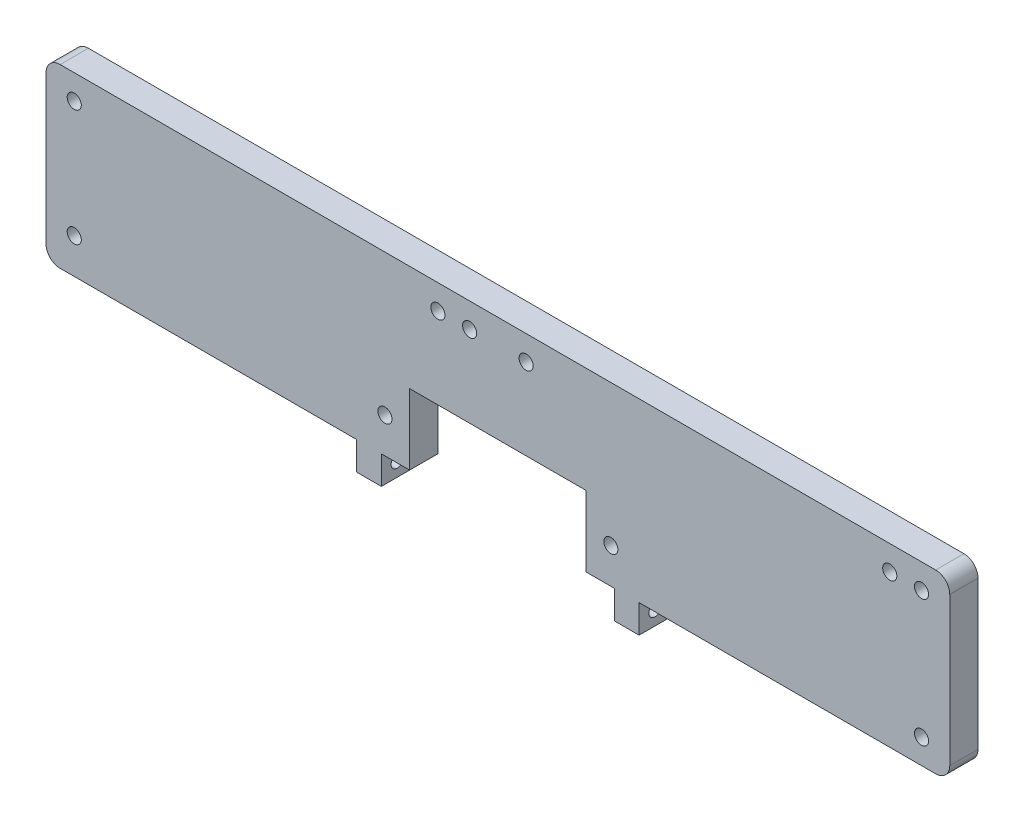
ISO-10303-21;
HEADER;
FILE_DESCRIPTION(('STEP AP214'),'2;1');
FILE_NAME('part.step','',(''),(''),'','','');
FILE_SCHEMA(('AUTOMOTIVE_DESIGN { 1 0 10303 214 1 1 1 1 }'));
ENDSEC;
DATA;
#1=APPLICATION_CONTEXT('core data for automotive mechanical design processes');
#2=APPLICATION_PROTOCOL_DEFINITION('international standard','automotive_design',2000,#1);
#3=PRODUCT_CONTEXT('',#1,'mechanical');
#4=PRODUCT('Part','Part','',(#3));
#5=PRODUCT_RELATED_PRODUCT_CATEGORY('part','',(#4));
#6=PRODUCT_DEFINITION_FORMATION('','',#4);
#7=PRODUCT_DEFINITION_CONTEXT('part definition',#1,'design');
#8=PRODUCT_DEFINITION('design','',#6,#7);
#9=PRODUCT_DEFINITION_SHAPE('','',#8);
#10=(LENGTH_UNIT() NAMED_UNIT(*) SI_UNIT(.MILLI.,.METRE.));
#11=(NAMED_UNIT(*) PLANE_ANGLE_UNIT() SI_UNIT($,.RADIAN.));
#12=(NAMED_UNIT(*) SI_UNIT($,.STERADIAN.) SOLID_ANGLE_UNIT());
#13=UNCERTAINTY_MEASURE_WITH_UNIT(LENGTH_MEASURE(1.E-05),#10,'distance_accuracy_value','');
#14=(GEOMETRIC_REPRESENTATION_CONTEXT(3) GLOBAL_UNCERTAINTY_ASSIGNED_CONTEXT((#13)) GLOBAL_UNIT_ASSIGNED_CONTEXT((#10,
#11,#12)) REPRESENTATION_CONTEXT('',''));
#15=CARTESIAN_POINT('',(0.,0.,0.));
#16=DIRECTION('',(0.,0.,1.));
#17=DIRECTION('',(1.,0.,0.));
#18=AXIS2_PLACEMENT_3D('',#15,#16,#17);
#19=CARTESIAN_POINT('',(-127.716190957769,22.106089776624,8.));
#20=DIRECTION('',(0.,1.,0.));
#21=DIRECTION('',(0.,0.,1.));
#22=AXIS2_PLACEMENT_3D('',#19,#20,#21);
#23=PLANE('',#22);
#24=DIRECTION('',(1.,0.,0.));
#25=VECTOR('',#24,1.);
#26=CARTESIAN_POINT('',(-127.716190957769,22.106089776624,0.));
#27=LINE('',#26,#25);
#28=CARTESIAN_POINT('',(-32.716190957769,22.106089776624,0.));
#29=VERTEX_POINT('',#28);
#30=CARTESIAN_POINT('',(-24.716190957769,22.106089776624,0.));
#31=VERTEX_POINT('',#30);
#32=EDGE_CURVE('E197',#29,#31,#27,.T.);
#33=ORIENTED_EDGE('',*,*,#32,.T.);
#34=DIRECTION('',(0.,0.,1.));
#35=VECTOR('',#34,1.);
#36=CARTESIAN_POINT('',(-24.716190957769,22.106089776624,0.));
#37=LINE('',#36,#35);
#38=CARTESIAN_POINT('',(-24.716190957769,22.106089776624,8.));
#39=VERTEX_POINT('',#38);
#40=EDGE_CURVE('E181',#31,#39,#37,.T.);
#41=ORIENTED_EDGE('',*,*,#40,.T.);
#42=DIRECTION('',(1.,0.,0.));
#43=VECTOR('',#42,1.);
#44=CARTESIAN_POINT('',(-127.716190957769,22.106089776624,8.));
#45=LINE('',#44,#43);
#46=CARTESIAN_POINT('',(-32.716190957769,22.106089776624,8.));
#47=VERTEX_POINT('',#46);
#48=EDGE_CURVE('E248',#47,#39,#45,.T.);
#49=ORIENTED_EDGE('',*,*,#48,.F.);
#50=DIRECTION('',(0.,0.,1.));
#51=VECTOR('',#50,1.);
#52=CARTESIAN_POINT('',(-32.716190957769,22.106089776624,0.));
#53=LINE('',#52,#51);
#54=EDGE_CURVE('E204',#29,#47,#53,.T.);
#55=ORIENTED_EDGE('',*,*,#54,.F.);
#56=EDGE_LOOP('',(#33,#41,#49,#55));
#57=FACE_BOUND('',#56,.T.);
#58=ADVANCED_FACE('F41',(#57),#23,.F.);
#59=CARTESIAN_POINT('',(25.283809042231,22.106089776624,8.));
#60=VERTEX_POINT('',#59);
#61=CARTESIAN_POINT('',(33.283809042231,22.106089776624,8.));
#62=VERTEX_POINT('',#61);
#63=EDGE_CURVE('E249',#60,#62,#45,.T.);
#64=ORIENTED_EDGE('',*,*,#63,.F.);
#65=DIRECTION('',(0.,0.,1.));
#66=VECTOR('',#65,1.);
#67=CARTESIAN_POINT('',(25.283809042231,22.106089776624,0.));
#68=LINE('',#67,#66);
#69=CARTESIAN_POINT('',(25.283809042231,22.106089776624,0.));
#70=VERTEX_POINT('',#69);
#71=EDGE_CURVE('E191',#70,#60,#68,.T.);
#72=ORIENTED_EDGE('',*,*,#71,.F.);
#73=CARTESIAN_POINT('',(33.283809042231,22.106089776624,0.));
#74=VERTEX_POINT('',#73);
#75=EDGE_CURVE('E207',#70,#74,#27,.T.);
#76=ORIENTED_EDGE('',*,*,#75,.T.);
#77=DIRECTION('',(0.,0.,1.));
#78=VECTOR('',#77,1.);
#79=CARTESIAN_POINT('',(33.283809042231,22.106089776624,0.));
#80=LINE('',#79,#78);
#81=EDGE_CURVE('E304',#74,#62,#80,.T.);
#82=ORIENTED_EDGE('',*,*,#81,.T.);
#83=EDGE_LOOP('',(#64,#72,#76,#82));
#84=FACE_BOUND('',#83,.T.);
#85=ADVANCED_FACE('F457',(#84),#23,.F.);
#86=DIRECTION('',(0.,0.,1.));
#87=VECTOR('',#86,1.);
#88=CARTESIAN_POINT('',(40.283809042231,22.106089776624,0.));
#89=LINE('',#88,#87);
#90=CARTESIAN_POINT('',(40.283809042231,22.106089776624,0.));
#91=VERTEX_POINT('',#90);
#92=CARTESIAN_POINT('',(40.283809042231,22.106089776624,8.));
#93=VERTEX_POINT('',#92);
#94=EDGE_CURVE('E300',#91,#93,#89,.T.);
#95=ORIENTED_EDGE('',*,*,#94,.F.);
#96=CARTESIAN_POINT('',(124.283809042231,22.106089776624,0.));
#97=VERTEX_POINT('',#96);
#98=EDGE_CURVE('E209',#91,#97,#27,.T.);
#99=ORIENTED_EDGE('',*,*,#98,.T.);
#100=DIRECTION('',(0.,0.,-1.));
#101=VECTOR('',#100,1.);
#102=CARTESIAN_POINT('',(124.283809042231,22.106089776624,8.));
#103=LINE('',#102,#101);
#104=CARTESIAN_POINT('',(124.283809042231,22.106089776624,8.));
#105=VERTEX_POINT('',#104);
#106=EDGE_CURVE('E239',#97,#105,#103,.F.);
#107=ORIENTED_EDGE('',*,*,#106,.T.);
#108=EDGE_CURVE('E250',#93,#105,#45,.T.);
#109=ORIENTED_EDGE('',*,*,#108,.F.);
#110=EDGE_LOOP('',(#95,#99,#107,#109));
#111=FACE_BOUND('',#110,.T.);
#112=ADVANCED_FACE('F463',(#111),#23,.F.);
#113=CARTESIAN_POINT('',(0.,0.,8.));
#114=DIRECTION('',(0.,0.,1.));
#115=DIRECTION('',(1.,0.,0.));
#116=AXIS2_PLACEMENT_3D('',#113,#114,#115);
#117=PLANE('',#116);
#118=CARTESIAN_POINT('',(120.283809042231,29.106089776624,8.));
#119=DIRECTION('',(0.,0.,1.));
#120=DIRECTION('',(1.,0.,0.));
#121=AXIS2_PLACEMENT_3D('',#118,#119,#120);
#122=CIRCLE('',#121,2.);
#123=CARTESIAN_POINT('',(122.283809042231,29.106089776624,8.));
#124=VERTEX_POINT('',#123);
#125=EDGE_CURVE('E399',#124,#124,#122,.T.);
#126=ORIENTED_EDGE('',*,*,#125,.F.);
#127=EDGE_LOOP('',(#126));
#128=FACE_BOUND('',#127,.T.);
#129=CARTESIAN_POINT('',(-119.716190957769,32.106089776624,8.));
#130=DIRECTION('',(0.,0.,1.));
#131=DIRECTION('',(1.,0.,0.));
#132=AXIS2_PLACEMENT_3D('',#129,#130,#131);
#133=CIRCLE('',#132,2.);
#134=CARTESIAN_POINT('',(-117.716190957769,32.106089776624,8.));
#135=VERTEX_POINT('',#134);
#136=EDGE_CURVE('E408',#135,#135,#133,.T.);
#137=ORIENTED_EDGE('',*,*,#136,.F.);
#138=EDGE_LOOP('',(#137));
#139=FACE_BOUND('',#138,.T.);
#140=CARTESIAN_POINT('',(32.283809042231,32.106089776624,8.));
#141=DIRECTION('',(0.,0.,1.));
#142=DIRECTION('',(1.,0.,0.));
#143=AXIS2_PLACEMENT_3D('',#140,#141,#142);
#144=CIRCLE('',#143,2.);
#145=CARTESIAN_POINT('',(34.283809042231,32.106089776624,8.));
#146=VERTEX_POINT('',#145);
#147=EDGE_CURVE('E416',#146,#146,#144,.T.);
#148=ORIENTED_EDGE('',*,*,#147,.F.);
#149=EDGE_LOOP('',(#148));
#150=FACE_BOUND('',#149,.T.);
#151=CARTESIAN_POINT('',(-31.716190957769,32.106089776624,8.));
#152=DIRECTION('',(0.,0.,1.));
#153=DIRECTION('',(1.,0.,0.));
#154=AXIS2_PLACEMENT_3D('',#151,#152,#153);
#155=CIRCLE('',#154,2.);
#156=CARTESIAN_POINT('',(-29.716190957769,32.106089776624,8.));
#157=VERTEX_POINT('',#156);
#158=EDGE_CURVE('E391',#157,#157,#155,.T.);
#159=ORIENTED_EDGE('',*,*,#158,.F.);
#160=EDGE_LOOP('',(#159));
#161=FACE_BOUND('',#160,.T.);
#162=DIRECTION('',(0.,-1.,0.));
#163=VECTOR('',#162,1.);
#164=CARTESIAN_POINT('',(-24.716190957769,42.106089776624,8.));
#165=LINE('',#164,#163);
#166=CARTESIAN_POINT('',(-24.716190957769,42.106089776624,8.));
#167=VERTEX_POINT('',#166);
#168=EDGE_CURVE('E186',#167,#39,#165,.T.);
#169=ORIENTED_EDGE('',*,*,#168,.F.);
#170=DIRECTION('',(-1.,0.,0.));
#171=VECTOR('',#170,1.);
#172=CARTESIAN_POINT('',(-24.716190957769,42.106089776624,8.));
#173=LINE('',#172,#171);
#174=CARTESIAN_POINT('',(25.283809042231,42.106089776624,8.));
#175=VERTEX_POINT('',#174);
#176=EDGE_CURVE('E201',#175,#167,#173,.T.);
#177=ORIENTED_EDGE('',*,*,#176,.F.);
#178=DIRECTION('',(0.,1.,0.));
#179=VECTOR('',#178,1.);
#180=CARTESIAN_POINT('',(25.283809042231,42.106089776624,8.));
#181=LINE('',#180,#179);
#182=EDGE_CURVE('E380',#60,#175,#181,.T.);
#183=ORIENTED_EDGE('',*,*,#182,.F.);
#184=ORIENTED_EDGE('',*,*,#63,.T.);
#185=DIRECTION('',(0.,-1.,0.));
#186=VECTOR('',#185,1.);
#187=CARTESIAN_POINT('',(33.283809042231,0.,8.));
#188=LINE('',#187,#186);
#189=CARTESIAN_POINT('',(33.283809042231,14.106089776624,8.));
#190=VERTEX_POINT('',#189);
#191=EDGE_CURVE('E319',#62,#190,#188,.T.);
#192=ORIENTED_EDGE('',*,*,#191,.T.);
#193=DIRECTION('',(1.,0.,0.));
#194=VECTOR('',#193,1.);
#195=CARTESIAN_POINT('',(0.,14.106089776624,8.));
#196=LINE('',#195,#194);
#197=CARTESIAN_POINT('',(40.283809042231,14.106089776624,8.));
#198=VERTEX_POINT('',#197);
#199=EDGE_CURVE('E314',#190,#198,#196,.T.);
#200=ORIENTED_EDGE('',*,*,#199,.T.);
#201=DIRECTION('',(0.,-1.,0.));
#202=VECTOR('',#201,1.);
#203=CARTESIAN_POINT('',(40.283809042231,0.,8.));
#204=LINE('',#203,#202);
#205=EDGE_CURVE('E323',#93,#198,#204,.T.);
#206=ORIENTED_EDGE('',*,*,#205,.F.);
#207=ORIENTED_EDGE('',*,*,#108,.T.);
#208=CARTESIAN_POINT('',(124.283809042231,26.106089776624,8.));
#209=DIRECTION('',(0.,0.,1.));
#210=DIRECTION('',(1.,0.,0.));
#211=AXIS2_PLACEMENT_3D('',#208,#209,#210);
#212=CIRCLE('',#211,4.);
#213=CARTESIAN_POINT('',(128.283809042231,26.106089776624,8.));
#214=VERTEX_POINT('',#213);
#215=EDGE_CURVE('E501',#105,#214,#212,.T.);
#216=ORIENTED_EDGE('',*,*,#215,.T.);
#217=DIRECTION('',(0.,1.,0.));
#218=VECTOR('',#217,1.);
#219=CARTESIAN_POINT('',(128.283809042231,72.106089776624,8.));
#220=LINE('',#219,#218);
#221=CARTESIAN_POINT('',(128.283809042231,68.106089776624,8.));
#222=VERTEX_POINT('',#221);
#223=EDGE_CURVE('E240',#214,#222,#220,.T.);
#224=ORIENTED_EDGE('',*,*,#223,.T.);
#225=CARTESIAN_POINT('',(124.283809042231,68.106089776624,8.));
#226=DIRECTION('',(0.,0.,1.));
#227=DIRECTION('',(1.,0.,0.));
#228=AXIS2_PLACEMENT_3D('',#225,#226,#227);
#229=CIRCLE('',#228,4.);
#230=CARTESIAN_POINT('',(124.283809042231,72.106089776624,8.));
#231=VERTEX_POINT('',#230);
#232=EDGE_CURVE('E526',#222,#231,#229,.T.);
#233=ORIENTED_EDGE('',*,*,#232,.T.);
#234=DIRECTION('',(-1.,0.,0.));
#235=VECTOR('',#234,1.);
#236=CARTESIAN_POINT('',(-127.716190957769,72.106089776624,8.));
#237=LINE('',#236,#235);
#238=CARTESIAN_POINT('',(-123.716190957769,72.106089776624,8.));
#239=VERTEX_POINT('',#238);
#240=EDGE_CURVE('E235',#231,#239,#237,.T.);
#241=ORIENTED_EDGE('',*,*,#240,.T.);
#242=CARTESIAN_POINT('',(-123.716190957769,68.106089776624,8.));
#243=DIRECTION('',(0.,0.,1.));
#244=DIRECTION('',(1.,0.,0.));
#245=AXIS2_PLACEMENT_3D('',#242,#243,#244);
#246=CIRCLE('',#245,4.);
#247=CARTESIAN_POINT('',(-127.716190957769,68.106089776624,8.));
#248=VERTEX_POINT('',#247);
#249=EDGE_CURVE('E523',#239,#248,#246,.T.);
#250=ORIENTED_EDGE('',*,*,#249,.T.);
#251=DIRECTION('',(0.,-1.,0.));
#252=VECTOR('',#251,1.);
#253=CARTESIAN_POINT('',(-127.716190957769,72.106089776624,8.));
#254=LINE('',#253,#252);
#255=CARTESIAN_POINT('',(-127.716190957769,26.106089776624,8.));
#256=VERTEX_POINT('',#255);
#257=EDGE_CURVE('E251',#248,#256,#254,.T.);
#258=ORIENTED_EDGE('',*,*,#257,.T.);
#259=CARTESIAN_POINT('',(-123.716190957769,26.106089776624,8.));
#260=DIRECTION('',(0.,0.,1.));
#261=DIRECTION('',(1.,0.,0.));
#262=AXIS2_PLACEMENT_3D('',#259,#260,#261);
#263=CIRCLE('',#262,4.);
#264=CARTESIAN_POINT('',(-123.716190957769,22.106089776624,8.));
#265=VERTEX_POINT('',#264);
#266=EDGE_CURVE('E531',#256,#265,#263,.T.);
#267=ORIENTED_EDGE('',*,*,#266,.T.);
#268=CARTESIAN_POINT('',(-39.7161909577704,22.106089776624,8.));
#269=VERTEX_POINT('',#268);
#270=EDGE_CURVE('E244',#265,#269,#45,.T.);
#271=ORIENTED_EDGE('',*,*,#270,.T.);
#272=DIRECTION('',(1.76074432811646E-13,-1.,0.));
#273=VECTOR('',#272,1.);
#274=CARTESIAN_POINT('',(-39.7161909577704,22.106089776624,8.));
#275=LINE('',#274,#273);
#276=CARTESIAN_POINT('',(-39.716190957769,14.106089776624,8.));
#277=VERTEX_POINT('',#276);
#278=EDGE_CURVE('E351',#269,#277,#275,.T.);
#279=ORIENTED_EDGE('',*,*,#278,.T.);
#280=DIRECTION('',(-1.,0.,0.));
#281=VECTOR('',#280,1.);
#282=CARTESIAN_POINT('',(-32.716190957769,14.106089776624,8.));
#283=LINE('',#282,#281);
#284=CARTESIAN_POINT('',(-32.716190957769,14.106089776624,8.));
#285=VERTEX_POINT('',#284);
#286=EDGE_CURVE('E327',#285,#277,#283,.T.);
#287=ORIENTED_EDGE('',*,*,#286,.F.);
#288=DIRECTION('',(0.,-1.,0.));
#289=VECTOR('',#288,1.);
#290=CARTESIAN_POINT('',(-32.716190957769,22.106089776624,8.));
#291=LINE('',#290,#289);
#292=EDGE_CURVE('E66',#47,#285,#291,.T.);
#293=ORIENTED_EDGE('',*,*,#292,.F.);
#294=ORIENTED_EDGE('',*,*,#48,.T.);
#295=EDGE_LOOP('',(#169,#177,#183,#184,#192,#200,#206,#207,#216,#224,#233,#241,#250,#258,#267,
#271,#279,#287,#293,#294));
#296=FACE_BOUND('',#295,.T.);
#297=CARTESIAN_POINT('',(-16.716190957769,65.106089776624,8.));
#298=DIRECTION('',(0.,0.,1.));
#299=DIRECTION('',(1.,0.,0.));
#300=AXIS2_PLACEMENT_3D('',#297,#298,#299);
#301=CIRCLE('',#300,2.);
#302=CARTESIAN_POINT('',(-14.716190957769,65.106089776624,8.));
#303=VERTEX_POINT('',#302);
#304=EDGE_CURVE('E280',#303,#303,#301,.T.);
#305=ORIENTED_EDGE('',*,*,#304,.F.);
#306=EDGE_LOOP('',(#305));
#307=FACE_BOUND('',#306,.T.);
#308=CARTESIAN_POINT('',(8.28380904223103,65.106089776624,8.));
#309=DIRECTION('',(0.,0.,1.));
#310=DIRECTION('',(1.,0.,0.));
#311=AXIS2_PLACEMENT_3D('',#308,#309,#310);
#312=CIRCLE('',#311,2.);
#313=CARTESIAN_POINT('',(10.283809042231,65.106089776624,8.));
#314=VERTEX_POINT('',#313);
#315=EDGE_CURVE('E264',#314,#314,#312,.T.);
#316=ORIENTED_EDGE('',*,*,#315,.F.);
#317=EDGE_LOOP('',(#316));
#318=FACE_BOUND('',#317,.T.);
#319=CARTESIAN_POINT('',(120.283809042231,65.106089776624,8.));
#320=DIRECTION('',(0.,0.,1.));
#321=DIRECTION('',(1.,0.,0.));
#322=AXIS2_PLACEMENT_3D('',#319,#320,#321);
#323=CIRCLE('',#322,2.);
#324=CARTESIAN_POINT('',(122.283809042231,65.106089776624,8.));
#325=VERTEX_POINT('',#324);
#326=EDGE_CURVE('E225',#325,#325,#323,.T.);
#327=ORIENTED_EDGE('',*,*,#326,.F.);
#328=EDGE_LOOP('',(#327));
#329=FACE_BOUND('',#328,.T.);
#330=CARTESIAN_POINT('',(111.283809042231,65.106089776624,8.));
#331=DIRECTION('',(0.,0.,1.));
#332=DIRECTION('',(1.,0.,0.));
#333=AXIS2_PLACEMENT_3D('',#330,#331,#332);
#334=CIRCLE('',#333,2.);
#335=CARTESIAN_POINT('',(113.283809042231,65.106089776624,8.));
#336=VERTEX_POINT('',#335);
#337=EDGE_CURVE('E258',#336,#336,#334,.T.);
#338=ORIENTED_EDGE('',*,*,#337,.F.);
#339=EDGE_LOOP('',(#338));
#340=FACE_BOUND('',#339,.T.);
#341=CARTESIAN_POINT('',(-7.71619095776897,65.106089776624,8.));
#342=DIRECTION('',(0.,0.,1.));
#343=DIRECTION('',(1.,0.,0.));
#344=AXIS2_PLACEMENT_3D('',#341,#342,#343);
#345=CIRCLE('',#344,2.);
#346=CARTESIAN_POINT('',(-5.71619095776897,65.106089776624,8.));
#347=VERTEX_POINT('',#346);
#348=EDGE_CURVE('E272',#347,#347,#345,.T.);
#349=ORIENTED_EDGE('',*,*,#348,.F.);
#350=EDGE_LOOP('',(#349));
#351=FACE_BOUND('',#350,.T.);
#352=CARTESIAN_POINT('',(-119.716190957769,65.106089776624,8.));
#353=DIRECTION('',(0.,0.,1.));
#354=DIRECTION('',(1.,0.,0.));
#355=AXIS2_PLACEMENT_3D('',#352,#353,#354);
#356=CIRCLE('',#355,2.);
#357=CARTESIAN_POINT('',(-117.716190957769,65.106089776624,8.));
#358=VERTEX_POINT('',#357);
#359=EDGE_CURVE('E288',#358,#358,#356,.T.);
#360=ORIENTED_EDGE('',*,*,#359,.F.);
#361=EDGE_LOOP('',(#360));
#362=FACE_BOUND('',#361,.T.);
#363=ADVANCED_FACE('F478',(#128,#139,#150,#161,#296,#307,#318,#329,#340,#351,#362),#117,.T.);
#364=CARTESIAN_POINT('',(0.,0.,0.));
#365=DIRECTION('',(0.,0.,1.));
#366=DIRECTION('',(1.,0.,0.));
#367=AXIS2_PLACEMENT_3D('',#364,#365,#366);
#368=PLANE('',#367);
#369=CARTESIAN_POINT('',(120.283809042231,29.106089776624,0.));
#370=DIRECTION('',(0.,0.,1.));
#371=DIRECTION('',(1.,0.,0.));
#372=AXIS2_PLACEMENT_3D('',#369,#370,#371);
#373=CIRCLE('',#372,2.);
#374=CARTESIAN_POINT('',(122.283809042231,29.106089776624,0.));
#375=VERTEX_POINT('',#374);
#376=EDGE_CURVE('E403',#375,#375,#373,.T.);
#377=ORIENTED_EDGE('',*,*,#376,.T.);
#378=EDGE_LOOP('',(#377));
#379=FACE_BOUND('',#378,.T.);
#380=CARTESIAN_POINT('',(-119.716190957769,32.106089776624,0.));
#381=DIRECTION('',(0.,0.,1.));
#382=DIRECTION('',(1.,0.,0.));
#383=AXIS2_PLACEMENT_3D('',#380,#381,#382);
#384=CIRCLE('',#383,2.);
#385=CARTESIAN_POINT('',(-117.716190957769,32.106089776624,0.));
#386=VERTEX_POINT('',#385);
#387=EDGE_CURVE('E412',#386,#386,#384,.T.);
#388=ORIENTED_EDGE('',*,*,#387,.T.);
#389=EDGE_LOOP('',(#388));
#390=FACE_BOUND('',#389,.T.);
#391=CARTESIAN_POINT('',(32.283809042231,32.106089776624,0.));
#392=DIRECTION('',(0.,0.,1.));
#393=DIRECTION('',(1.,0.,0.));
#394=AXIS2_PLACEMENT_3D('',#391,#392,#393);
#395=CIRCLE('',#394,2.);
#396=CARTESIAN_POINT('',(34.283809042231,32.106089776624,0.));
#397=VERTEX_POINT('',#396);
#398=EDGE_CURVE('E395',#397,#397,#395,.T.);
#399=ORIENTED_EDGE('',*,*,#398,.T.);
#400=EDGE_LOOP('',(#399));
#401=FACE_BOUND('',#400,.T.);
#402=CARTESIAN_POINT('',(-31.716190957769,32.106089776624,0.));
#403=DIRECTION('',(0.,0.,1.));
#404=DIRECTION('',(1.,0.,0.));
#405=AXIS2_PLACEMENT_3D('',#402,#403,#404);
#406=CIRCLE('',#405,2.);
#407=CARTESIAN_POINT('',(-29.716190957769,32.106089776624,0.));
#408=VERTEX_POINT('',#407);
#409=EDGE_CURVE('E386',#408,#408,#406,.T.);
#410=ORIENTED_EDGE('',*,*,#409,.T.);
#411=EDGE_LOOP('',(#410));
#412=FACE_BOUND('',#411,.T.);
#413=DIRECTION('',(-1.,0.,0.));
#414=VECTOR('',#413,1.);
#415=CARTESIAN_POINT('',(-24.716190957769,42.106089776624,0.));
#416=LINE('',#415,#414);
#417=CARTESIAN_POINT('',(25.283809042231,42.106089776624,0.));
#418=VERTEX_POINT('',#417);
#419=CARTESIAN_POINT('',(-24.716190957769,42.106089776624,0.));
#420=VERTEX_POINT('',#419);
#421=EDGE_CURVE('E58',#418,#420,#416,.T.);
#422=ORIENTED_EDGE('',*,*,#421,.T.);
#423=DIRECTION('',(0.,-1.,0.));
#424=VECTOR('',#423,1.);
#425=CARTESIAN_POINT('',(-24.716190957769,42.106089776624,0.));
#426=LINE('',#425,#424);
#427=EDGE_CURVE('E184',#420,#31,#426,.T.);
#428=ORIENTED_EDGE('',*,*,#427,.T.);
#429=ORIENTED_EDGE('',*,*,#32,.F.);
#430=DIRECTION('',(0.,-1.,0.));
#431=VECTOR('',#430,1.);
#432=CARTESIAN_POINT('',(-32.716190957769,22.106089776624,0.));
#433=LINE('',#432,#431);
#434=CARTESIAN_POINT('',(-32.716190957769,14.106089776624,0.));
#435=VERTEX_POINT('',#434);
#436=EDGE_CURVE('E344',#29,#435,#433,.T.);
#437=ORIENTED_EDGE('',*,*,#436,.T.);
#438=DIRECTION('',(-1.,0.,0.));
#439=VECTOR('',#438,1.);
#440=CARTESIAN_POINT('',(-32.716190957769,14.106089776624,0.));
#441=LINE('',#440,#439);
#442=CARTESIAN_POINT('',(-39.716190957769,14.106089776624,0.));
#443=VERTEX_POINT('',#442);
#444=EDGE_CURVE('E337',#435,#443,#441,.T.);
#445=ORIENTED_EDGE('',*,*,#444,.T.);
#446=DIRECTION('',(1.76074432811646E-13,-1.,0.));
#447=VECTOR('',#446,1.);
#448=CARTESIAN_POINT('',(-39.7161909577704,22.106089776624,0.));
#449=LINE('',#448,#447);
#450=CARTESIAN_POINT('',(-39.7161909577704,22.106089776624,0.));
#451=VERTEX_POINT('',#450);
#452=EDGE_CURVE('E340',#451,#443,#449,.T.);
#453=ORIENTED_EDGE('',*,*,#452,.F.);
#454=CARTESIAN_POINT('',(-123.716190957769,22.106089776624,0.));
#455=VERTEX_POINT('',#454);
#456=EDGE_CURVE('E206',#455,#451,#27,.T.);
#457=ORIENTED_EDGE('',*,*,#456,.F.);
#458=CARTESIAN_POINT('',(-123.716190957769,26.106089776624,0.));
#459=DIRECTION('',(0.,0.,1.));
#460=DIRECTION('',(1.,0.,0.));
#461=AXIS2_PLACEMENT_3D('',#458,#459,#460);
#462=CIRCLE('',#461,4.);
#463=CARTESIAN_POINT('',(-127.716190957769,26.106089776624,0.));
#464=VERTEX_POINT('',#463);
#465=EDGE_CURVE('E496',#455,#464,#462,.F.);
#466=ORIENTED_EDGE('',*,*,#465,.T.);
#467=DIRECTION('',(0.,-1.,0.));
#468=VECTOR('',#467,1.);
#469=CARTESIAN_POINT('',(-127.716190957769,72.106089776624,0.));
#470=LINE('',#469,#468);
#471=CARTESIAN_POINT('',(-127.716190957769,68.106089776624,0.));
#472=VERTEX_POINT('',#471);
#473=EDGE_CURVE('E217',#472,#464,#470,.T.);
#474=ORIENTED_EDGE('',*,*,#473,.F.);
#475=CARTESIAN_POINT('',(-123.716190957769,68.106089776624,0.));
#476=DIRECTION('',(0.,0.,1.));
#477=DIRECTION('',(1.,0.,0.));
#478=AXIS2_PLACEMENT_3D('',#475,#476,#477);
#479=CIRCLE('',#478,4.);
#480=CARTESIAN_POINT('',(-123.716190957769,72.106089776624,0.));
#481=VERTEX_POINT('',#480);
#482=EDGE_CURVE('E507',#472,#481,#479,.F.);
#483=ORIENTED_EDGE('',*,*,#482,.T.);
#484=DIRECTION('',(-1.,0.,0.));
#485=VECTOR('',#484,1.);
#486=CARTESIAN_POINT('',(-127.716190957769,72.106089776624,0.));
#487=LINE('',#486,#485);
#488=CARTESIAN_POINT('',(124.283809042231,72.106089776624,0.));
#489=VERTEX_POINT('',#488);
#490=EDGE_CURVE('E255',#489,#481,#487,.T.);
#491=ORIENTED_EDGE('',*,*,#490,.F.);
#492=CARTESIAN_POINT('',(124.283809042231,68.106089776624,0.));
#493=DIRECTION('',(0.,0.,1.));
#494=DIRECTION('',(1.,0.,0.));
#495=AXIS2_PLACEMENT_3D('',#492,#493,#494);
#496=CIRCLE('',#495,4.);
#497=CARTESIAN_POINT('',(128.283809042231,68.106089776624,0.));
#498=VERTEX_POINT('',#497);
#499=EDGE_CURVE('E497',#489,#498,#496,.F.);
#500=ORIENTED_EDGE('',*,*,#499,.T.);
#501=DIRECTION('',(0.,1.,0.));
#502=VECTOR('',#501,1.);
#503=CARTESIAN_POINT('',(128.283809042231,72.106089776624,0.));
#504=LINE('',#503,#502);
#505=CARTESIAN_POINT('',(128.283809042231,26.106089776624,0.));
#506=VERTEX_POINT('',#505);
#507=EDGE_CURVE('E213',#506,#498,#504,.T.);
#508=ORIENTED_EDGE('',*,*,#507,.F.);
#509=CARTESIAN_POINT('',(124.283809042231,26.106089776624,0.));
#510=DIRECTION('',(0.,0.,1.));
#511=DIRECTION('',(1.,0.,0.));
#512=AXIS2_PLACEMENT_3D('',#509,#510,#511);
#513=CIRCLE('',#512,4.);
#514=EDGE_CURVE('E489',#506,#97,#513,.F.);
#515=ORIENTED_EDGE('',*,*,#514,.T.);
#516=ORIENTED_EDGE('',*,*,#98,.F.);
#517=DIRECTION('',(0.,-1.,0.));
#518=VECTOR('',#517,1.);
#519=CARTESIAN_POINT('',(40.283809042231,0.,0.));
#520=LINE('',#519,#518);
#521=CARTESIAN_POINT('',(40.283809042231,14.106089776624,0.));
#522=VERTEX_POINT('',#521);
#523=EDGE_CURVE('E318',#91,#522,#520,.T.);
#524=ORIENTED_EDGE('',*,*,#523,.T.);
#525=DIRECTION('',(1.,0.,0.));
#526=VECTOR('',#525,1.);
#527=CARTESIAN_POINT('',(0.,14.106089776624,0.));
#528=LINE('',#527,#526);
#529=CARTESIAN_POINT('',(33.283809042231,14.106089776624,0.));
#530=VERTEX_POINT('',#529);
#531=EDGE_CURVE('E305',#530,#522,#528,.T.);
#532=ORIENTED_EDGE('',*,*,#531,.F.);
#533=DIRECTION('',(0.,-1.,0.));
#534=VECTOR('',#533,1.);
#535=CARTESIAN_POINT('',(33.283809042231,0.,0.));
#536=LINE('',#535,#534);
#537=EDGE_CURVE('E331',#74,#530,#536,.T.);
#538=ORIENTED_EDGE('',*,*,#537,.F.);
#539=ORIENTED_EDGE('',*,*,#75,.F.);
#540=DIRECTION('',(0.,1.,0.));
#541=VECTOR('',#540,1.);
#542=CARTESIAN_POINT('',(25.283809042231,42.106089776624,0.));
#543=LINE('',#542,#541);
#544=EDGE_CURVE('E200',#70,#418,#543,.T.);
#545=ORIENTED_EDGE('',*,*,#544,.T.);
#546=EDGE_LOOP('',(#422,#428,#429,#437,#445,#453,#457,#466,#474,#483,#491,#500,#508,#515,#516,
#524,#532,#538,#539,#545));
#547=FACE_BOUND('',#546,.T.);
#548=CARTESIAN_POINT('',(120.283809042231,65.106089776624,0.));
#549=DIRECTION('',(0.,0.,1.));
#550=DIRECTION('',(1.,0.,0.));
#551=AXIS2_PLACEMENT_3D('',#548,#549,#550);
#552=CIRCLE('',#551,2.);
#553=CARTESIAN_POINT('',(122.283809042231,65.106089776624,0.));
#554=VERTEX_POINT('',#553);
#555=EDGE_CURVE('E232',#554,#554,#552,.T.);
#556=ORIENTED_EDGE('',*,*,#555,.T.);
#557=EDGE_LOOP('',(#556));
#558=FACE_BOUND('',#557,.T.);
#559=CARTESIAN_POINT('',(111.283809042231,65.106089776624,0.));
#560=DIRECTION('',(0.,0.,1.));
#561=DIRECTION('',(1.,0.,0.));
#562=AXIS2_PLACEMENT_3D('',#559,#560,#561);
#563=CIRCLE('',#562,2.);
#564=CARTESIAN_POINT('',(113.283809042231,65.106089776624,0.));
#565=VERTEX_POINT('',#564);
#566=EDGE_CURVE('E260',#565,#565,#563,.T.);
#567=ORIENTED_EDGE('',*,*,#566,.T.);
#568=EDGE_LOOP('',(#567));
#569=FACE_BOUND('',#568,.T.);
#570=CARTESIAN_POINT('',(8.28380904223103,65.106089776624,0.));
#571=DIRECTION('',(0.,0.,1.));
#572=DIRECTION('',(1.,0.,0.));
#573=AXIS2_PLACEMENT_3D('',#570,#571,#572);
#574=CIRCLE('',#573,2.);
#575=CARTESIAN_POINT('',(10.283809042231,65.106089776624,0.));
#576=VERTEX_POINT('',#575);
#577=EDGE_CURVE('E268',#576,#576,#574,.T.);
#578=ORIENTED_EDGE('',*,*,#577,.T.);
#579=EDGE_LOOP('',(#578));
#580=FACE_BOUND('',#579,.T.);
#581=CARTESIAN_POINT('',(-7.71619095776897,65.106089776624,0.));
#582=DIRECTION('',(0.,0.,1.));
#583=DIRECTION('',(1.,0.,0.));
#584=AXIS2_PLACEMENT_3D('',#581,#582,#583);
#585=CIRCLE('',#584,2.);
#586=CARTESIAN_POINT('',(-5.71619095776897,65.106089776624,0.));
#587=VERTEX_POINT('',#586);
#588=EDGE_CURVE('E276',#587,#587,#585,.T.);
#589=ORIENTED_EDGE('',*,*,#588,.T.);
#590=EDGE_LOOP('',(#589));
#591=FACE_BOUND('',#590,.T.);
#592=CARTESIAN_POINT('',(-16.716190957769,65.106089776624,0.));
#593=DIRECTION('',(0.,0.,1.));
#594=DIRECTION('',(1.,0.,0.));
#595=AXIS2_PLACEMENT_3D('',#592,#593,#594);
#596=CIRCLE('',#595,2.);
#597=CARTESIAN_POINT('',(-14.716190957769,65.106089776624,0.));
#598=VERTEX_POINT('',#597);
#599=EDGE_CURVE('E284',#598,#598,#596,.T.);
#600=ORIENTED_EDGE('',*,*,#599,.T.);
#601=EDGE_LOOP('',(#600));
#602=FACE_BOUND('',#601,.T.);
#603=CARTESIAN_POINT('',(-119.716190957769,65.106089776624,0.));
#604=DIRECTION('',(0.,0.,1.));
#605=DIRECTION('',(1.,0.,0.));
#606=AXIS2_PLACEMENT_3D('',#603,#604,#605);
#607=CIRCLE('',#606,2.);
#608=CARTESIAN_POINT('',(-117.716190957769,65.106089776624,0.));
#609=VERTEX_POINT('',#608);
#610=EDGE_CURVE('E292',#609,#609,#607,.T.);
#611=ORIENTED_EDGE('',*,*,#610,.T.);
#612=EDGE_LOOP('',(#611));
#613=FACE_BOUND('',#612,.T.);
#614=ADVANCED_FACE('F195',(#379,#390,#401,#412,#547,#558,#569,#580,#591,#602,#613),#368,.F.);
#615=CARTESIAN_POINT('',(-127.716190957769,72.106089776624,8.));
#616=DIRECTION('',(1.,0.,0.));
#617=DIRECTION('',(0.,0.,-1.));
#618=AXIS2_PLACEMENT_3D('',#615,#616,#617);
#619=PLANE('',#618);
#620=ORIENTED_EDGE('',*,*,#473,.T.);
#621=DIRECTION('',(0.,0.,-1.));
#622=VECTOR('',#621,1.);
#623=CARTESIAN_POINT('',(-127.716190957769,26.106089776624,8.));
#624=LINE('',#623,#622);
#625=EDGE_CURVE('E520',#464,#256,#624,.F.);
#626=ORIENTED_EDGE('',*,*,#625,.T.);
#627=ORIENTED_EDGE('',*,*,#257,.F.);
#628=DIRECTION('',(0.,0.,-1.));
#629=VECTOR('',#628,1.);
#630=CARTESIAN_POINT('',(-127.716190957769,68.106089776624,8.));
#631=LINE('',#630,#629);
#632=EDGE_CURVE('E517',#248,#472,#631,.T.);
#633=ORIENTED_EDGE('',*,*,#632,.T.);
#634=EDGE_LOOP('',(#620,#626,#627,#633));
#635=FACE_BOUND('',#634,.T.);
#636=ADVANCED_FACE('F469',(#635),#619,.F.);
#637=ORIENTED_EDGE('',*,*,#456,.T.);
#638=DIRECTION('',(0.,0.,1.));
#639=VECTOR('',#638,1.);
#640=CARTESIAN_POINT('',(-39.7161909577704,22.106089776624,0.));
#641=LINE('',#640,#639);
#642=EDGE_CURVE('E362',#451,#269,#641,.T.);
#643=ORIENTED_EDGE('',*,*,#642,.T.);
#644=ORIENTED_EDGE('',*,*,#270,.F.);
#645=DIRECTION('',(0.,0.,-1.));
#646=VECTOR('',#645,1.);
#647=CARTESIAN_POINT('',(-123.716190957769,22.106089776624,8.));
#648=LINE('',#647,#646);
#649=EDGE_CURVE('E503',#265,#455,#648,.T.);
#650=ORIENTED_EDGE('',*,*,#649,.T.);
#651=EDGE_LOOP('',(#637,#643,#644,#650));
#652=FACE_BOUND('',#651,.T.);
#653=ADVANCED_FACE('F459',(#652),#23,.F.);
#654=CARTESIAN_POINT('',(128.283809042231,72.106089776624,8.));
#655=DIRECTION('',(-1.,0.,0.));
#656=DIRECTION('',(0.,0.,1.));
#657=AXIS2_PLACEMENT_3D('',#654,#655,#656);
#658=PLANE('',#657);
#659=ORIENTED_EDGE('',*,*,#223,.F.);
#660=DIRECTION('',(0.,0.,-1.));
#661=VECTOR('',#660,1.);
#662=CARTESIAN_POINT('',(128.283809042231,26.106089776624,8.));
#663=LINE('',#662,#661);
#664=EDGE_CURVE('E537',#214,#506,#663,.T.);
#665=ORIENTED_EDGE('',*,*,#664,.T.);
#666=ORIENTED_EDGE('',*,*,#507,.T.);
#667=DIRECTION('',(0.,0.,-1.));
#668=VECTOR('',#667,1.);
#669=CARTESIAN_POINT('',(128.283809042231,68.106089776624,8.));
#670=LINE('',#669,#668);
#671=EDGE_CURVE('E534',#498,#222,#670,.F.);
#672=ORIENTED_EDGE('',*,*,#671,.T.);
#673=EDGE_LOOP('',(#659,#665,#666,#672));
#674=FACE_BOUND('',#673,.T.);
#675=ADVANCED_FACE('F468',(#674),#658,.F.);
#676=CARTESIAN_POINT('',(-127.716190957769,72.106089776624,8.));
#677=DIRECTION('',(0.,-1.,0.));
#678=DIRECTION('',(0.,0.,-1.));
#679=AXIS2_PLACEMENT_3D('',#676,#677,#678);
#680=PLANE('',#679);
#681=ORIENTED_EDGE('',*,*,#240,.F.);
#682=DIRECTION('',(0.,0.,-1.));
#683=VECTOR('',#682,1.);
#684=CARTESIAN_POINT('',(124.283809042231,72.106089776624,8.));
#685=LINE('',#684,#683);
#686=EDGE_CURVE('E11',#231,#489,#685,.T.);
#687=ORIENTED_EDGE('',*,*,#686,.T.);
#688=ORIENTED_EDGE('',*,*,#490,.T.);
#689=DIRECTION('',(0.,0.,-1.));
#690=VECTOR('',#689,1.);
#691=CARTESIAN_POINT('',(-123.716190957769,72.106089776624,8.));
#692=LINE('',#691,#690);
#693=EDGE_CURVE('E51',#481,#239,#692,.F.);
#694=ORIENTED_EDGE('',*,*,#693,.T.);
#695=EDGE_LOOP('',(#681,#687,#688,#694));
#696=FACE_BOUND('',#695,.T.);
#697=ADVANCED_FACE('F475',(#696),#680,.F.);
#698=CARTESIAN_POINT('',(120.283809042231,65.106089776624,8.));
#699=DIRECTION('',(0.,0.,-1.));
#700=DIRECTION('',(-1.,0.,0.));
#701=AXIS2_PLACEMENT_3D('',#698,#699,#700);
#702=CYLINDRICAL_SURFACE('',#701,2.);
#703=ORIENTED_EDGE('',*,*,#326,.T.);
#704=EDGE_LOOP('',(#703));
#705=FACE_BOUND('',#704,.T.);
#706=ORIENTED_EDGE('',*,*,#555,.F.);
#707=EDGE_LOOP('',(#706));
#708=FACE_BOUND('',#707,.T.);
#709=ADVANCED_FACE('F633',(#705,#708),#702,.F.);
#710=CARTESIAN_POINT('',(111.283809042231,65.106089776624,8.));
#711=DIRECTION('',(0.,0.,-1.));
#712=DIRECTION('',(-1.,0.,0.));
#713=AXIS2_PLACEMENT_3D('',#710,#711,#712);
#714=CYLINDRICAL_SURFACE('',#713,2.);
#715=ORIENTED_EDGE('',*,*,#337,.T.);
#716=EDGE_LOOP('',(#715));
#717=FACE_BOUND('',#716,.T.);
#718=ORIENTED_EDGE('',*,*,#566,.F.);
#719=EDGE_LOOP('',(#718));
#720=FACE_BOUND('',#719,.T.);
#721=ADVANCED_FACE('F629',(#717,#720),#714,.F.);
#722=CARTESIAN_POINT('',(8.28380904223103,65.106089776624,8.));
#723=DIRECTION('',(0.,0.,-1.));
#724=DIRECTION('',(-1.,0.,0.));
#725=AXIS2_PLACEMENT_3D('',#722,#723,#724);
#726=CYLINDRICAL_SURFACE('',#725,2.);
#727=ORIENTED_EDGE('',*,*,#315,.T.);
#728=EDGE_LOOP('',(#727));
#729=FACE_BOUND('',#728,.T.);
#730=ORIENTED_EDGE('',*,*,#577,.F.);
#731=EDGE_LOOP('',(#730));
#732=FACE_BOUND('',#731,.T.);
#733=ADVANCED_FACE('F625',(#729,#732),#726,.F.);
#734=CARTESIAN_POINT('',(-7.71619095776897,65.106089776624,8.));
#735=DIRECTION('',(0.,0.,-1.));
#736=DIRECTION('',(-1.,0.,0.));
#737=AXIS2_PLACEMENT_3D('',#734,#735,#736);
#738=CYLINDRICAL_SURFACE('',#737,2.);
#739=ORIENTED_EDGE('',*,*,#348,.T.);
#740=EDGE_LOOP('',(#739));
#741=FACE_BOUND('',#740,.T.);
#742=ORIENTED_EDGE('',*,*,#588,.F.);
#743=EDGE_LOOP('',(#742));
#744=FACE_BOUND('',#743,.T.);
#745=ADVANCED_FACE('F621',(#741,#744),#738,.F.);
#746=CARTESIAN_POINT('',(-16.716190957769,65.106089776624,8.));
#747=DIRECTION('',(0.,0.,-1.));
#748=DIRECTION('',(-1.,0.,0.));
#749=AXIS2_PLACEMENT_3D('',#746,#747,#748);
#750=CYLINDRICAL_SURFACE('',#749,2.);
#751=ORIENTED_EDGE('',*,*,#304,.T.);
#752=EDGE_LOOP('',(#751));
#753=FACE_BOUND('',#752,.T.);
#754=ORIENTED_EDGE('',*,*,#599,.F.);
#755=EDGE_LOOP('',(#754));
#756=FACE_BOUND('',#755,.T.);
#757=ADVANCED_FACE('F617',(#753,#756),#750,.F.);
#758=CARTESIAN_POINT('',(-119.716190957769,65.106089776624,8.));
#759=DIRECTION('',(0.,0.,-1.));
#760=DIRECTION('',(-1.,0.,0.));
#761=AXIS2_PLACEMENT_3D('',#758,#759,#760);
#762=CYLINDRICAL_SURFACE('',#761,2.);
#763=ORIENTED_EDGE('',*,*,#359,.T.);
#764=EDGE_LOOP('',(#763));
#765=FACE_BOUND('',#764,.T.);
#766=ORIENTED_EDGE('',*,*,#610,.F.);
#767=EDGE_LOOP('',(#766));
#768=FACE_BOUND('',#767,.T.);
#769=ADVANCED_FACE('F614',(#765,#768),#762,.F.);
#770=CARTESIAN_POINT('',(-123.716190957769,26.106089776624,8.));
#771=DIRECTION('',(0.,0.,-1.));
#772=DIRECTION('',(-1.,0.,0.));
#773=AXIS2_PLACEMENT_3D('',#770,#771,#772);
#774=CYLINDRICAL_SURFACE('',#773,4.);
#775=ORIENTED_EDGE('',*,*,#266,.F.);
#776=ORIENTED_EDGE('',*,*,#625,.F.);
#777=ORIENTED_EDGE('',*,*,#465,.F.);
#778=ORIENTED_EDGE('',*,*,#649,.F.);
#779=EDGE_LOOP('',(#775,#776,#777,#778));
#780=FACE_BOUND('',#779,.T.);
#781=ADVANCED_FACE('F558',(#780),#774,.T.);
#782=CARTESIAN_POINT('',(124.283809042231,26.106089776624,8.));
#783=DIRECTION('',(0.,0.,-1.));
#784=DIRECTION('',(-1.,0.,0.));
#785=AXIS2_PLACEMENT_3D('',#782,#783,#784);
#786=CYLINDRICAL_SURFACE('',#785,4.);
#787=ORIENTED_EDGE('',*,*,#215,.F.);
#788=ORIENTED_EDGE('',*,*,#106,.F.);
#789=ORIENTED_EDGE('',*,*,#514,.F.);
#790=ORIENTED_EDGE('',*,*,#664,.F.);
#791=EDGE_LOOP('',(#787,#788,#789,#790));
#792=FACE_BOUND('',#791,.T.);
#793=ADVANCED_FACE('F500',(#792),#786,.T.);
#794=CARTESIAN_POINT('',(124.283809042231,68.106089776624,8.));
#795=DIRECTION('',(0.,0.,-1.));
#796=DIRECTION('',(-1.,0.,0.));
#797=AXIS2_PLACEMENT_3D('',#794,#795,#796);
#798=CYLINDRICAL_SURFACE('',#797,4.);
#799=ORIENTED_EDGE('',*,*,#232,.F.);
#800=ORIENTED_EDGE('',*,*,#671,.F.);
#801=ORIENTED_EDGE('',*,*,#499,.F.);
#802=ORIENTED_EDGE('',*,*,#686,.F.);
#803=EDGE_LOOP('',(#799,#800,#801,#802));
#804=FACE_BOUND('',#803,.T.);
#805=ADVANCED_FACE('F683',(#804),#798,.T.);
#806=CARTESIAN_POINT('',(-123.716190957769,68.106089776624,8.));
#807=DIRECTION('',(0.,0.,-1.));
#808=DIRECTION('',(-1.,0.,0.));
#809=AXIS2_PLACEMENT_3D('',#806,#807,#808);
#810=CYLINDRICAL_SURFACE('',#809,4.);
#811=ORIENTED_EDGE('',*,*,#249,.F.);
#812=ORIENTED_EDGE('',*,*,#693,.F.);
#813=ORIENTED_EDGE('',*,*,#482,.F.);
#814=ORIENTED_EDGE('',*,*,#632,.F.);
#815=EDGE_LOOP('',(#811,#812,#813,#814));
#816=FACE_BOUND('',#815,.T.);
#817=ADVANCED_FACE('F43',(#816),#810,.T.);
#818=CARTESIAN_POINT('',(40.283809042231,0.,0.));
#819=DIRECTION('',(-1.,0.,0.));
#820=DIRECTION('',(0.,0.,1.));
#821=AXIS2_PLACEMENT_3D('',#818,#819,#820);
#822=PLANE('',#821);
#823=CARTESIAN_POINT('',(40.283809042231,18.106089776624,3.5));
#824=DIRECTION('',(-1.,0.,0.));
#825=DIRECTION('',(0.,0.,1.));
#826=AXIS2_PLACEMENT_3D('',#823,#824,#825);
#827=CIRCLE('',#826,1.75);
#828=CARTESIAN_POINT('',(40.283809042231,18.106089776624,5.25));
#829=VERTEX_POINT('',#828);
#830=EDGE_CURVE('E404',#829,#829,#827,.T.);
#831=ORIENTED_EDGE('',*,*,#830,.T.);
#832=EDGE_LOOP('',(#831));
#833=FACE_BOUND('',#832,.T.);
#834=ORIENTED_EDGE('',*,*,#205,.T.);
#835=DIRECTION('',(0.,0.,1.));
#836=VECTOR('',#835,1.);
#837=CARTESIAN_POINT('',(40.283809042231,14.106089776624,0.));
#838=LINE('',#837,#836);
#839=EDGE_CURVE('E296',#522,#198,#838,.T.);
#840=ORIENTED_EDGE('',*,*,#839,.F.);
#841=ORIENTED_EDGE('',*,*,#523,.F.);
#842=ORIENTED_EDGE('',*,*,#94,.T.);
#843=EDGE_LOOP('',(#834,#840,#841,#842));
#844=FACE_BOUND('',#843,.T.);
#845=ADVANCED_FACE('F572',(#833,#844),#822,.F.);
#846=CARTESIAN_POINT('',(0.,14.106089776624,0.));
#847=DIRECTION('',(0.,-1.,0.));
#848=DIRECTION('',(0.,0.,-1.));
#849=AXIS2_PLACEMENT_3D('',#846,#847,#848);
#850=PLANE('',#849);
#851=ORIENTED_EDGE('',*,*,#199,.F.);
#852=DIRECTION('',(0.,0.,1.));
#853=VECTOR('',#852,1.);
#854=CARTESIAN_POINT('',(33.283809042231,14.106089776624,0.));
#855=LINE('',#854,#853);
#856=EDGE_CURVE('E309',#530,#190,#855,.T.);
#857=ORIENTED_EDGE('',*,*,#856,.F.);
#858=ORIENTED_EDGE('',*,*,#531,.T.);
#859=ORIENTED_EDGE('',*,*,#839,.T.);
#860=EDGE_LOOP('',(#851,#857,#858,#859));
#861=FACE_BOUND('',#860,.T.);
#862=ADVANCED_FACE('F574',(#861),#850,.T.);
#863=CARTESIAN_POINT('',(33.283809042231,0.,0.));
#864=DIRECTION('',(-1.,0.,0.));
#865=DIRECTION('',(0.,-1.,0.));
#866=AXIS2_PLACEMENT_3D('',#863,#864,#865);
#867=PLANE('',#866);
#868=CARTESIAN_POINT('',(33.283809042231,18.106089776624,3.5));
#869=DIRECTION('',(-1.,0.,0.));
#870=DIRECTION('',(0.,-1.,0.));
#871=AXIS2_PLACEMENT_3D('',#868,#869,#870);
#872=CIRCLE('',#871,1.75);
#873=CARTESIAN_POINT('',(33.283809042231,16.356089776624,3.5));
#874=VERTEX_POINT('',#873);
#875=EDGE_CURVE('E426',#874,#874,#872,.T.);
#876=ORIENTED_EDGE('',*,*,#875,.F.);
#877=EDGE_LOOP('',(#876));
#878=FACE_BOUND('',#877,.T.);
#879=ORIENTED_EDGE('',*,*,#191,.F.);
#880=ORIENTED_EDGE('',*,*,#81,.F.);
#881=ORIENTED_EDGE('',*,*,#537,.T.);
#882=ORIENTED_EDGE('',*,*,#856,.T.);
#883=EDGE_LOOP('',(#879,#880,#881,#882));
#884=FACE_BOUND('',#883,.T.);
#885=ADVANCED_FACE('F580',(#878,#884),#867,.T.);
#886=CARTESIAN_POINT('',(-32.716190957769,14.106089776624,0.));
#887=DIRECTION('',(0.,1.,0.));
#888=DIRECTION('',(-1.,0.,0.));
#889=AXIS2_PLACEMENT_3D('',#886,#887,#888);
#890=PLANE('',#889);
#891=ORIENTED_EDGE('',*,*,#286,.T.);
#892=DIRECTION('',(0.,0.,1.));
#893=VECTOR('',#892,1.);
#894=CARTESIAN_POINT('',(-39.716190957769,14.106089776624,0.));
#895=LINE('',#894,#893);
#896=EDGE_CURVE('E366',#443,#277,#895,.T.);
#897=ORIENTED_EDGE('',*,*,#896,.F.);
#898=ORIENTED_EDGE('',*,*,#444,.F.);
#899=DIRECTION('',(0.,0.,1.));
#900=VECTOR('',#899,1.);
#901=CARTESIAN_POINT('',(-32.716190957769,14.106089776624,0.));
#902=LINE('',#901,#900);
#903=EDGE_CURVE('E347',#435,#285,#902,.T.);
#904=ORIENTED_EDGE('',*,*,#903,.T.);
#905=EDGE_LOOP('',(#891,#897,#898,#904));
#906=FACE_BOUND('',#905,.T.);
#907=ADVANCED_FACE('F565',(#906),#890,.F.);
#908=CARTESIAN_POINT('',(-39.7161909577704,22.106089776624,0.));
#909=DIRECTION('',(-1.,-1.76074432811646E-13,0.));
#910=DIRECTION('',(1.76074432811646E-13,-1.,0.));
#911=AXIS2_PLACEMENT_3D('',#908,#909,#910);
#912=PLANE('',#911);
#913=CARTESIAN_POINT('',(-39.7161909577665,18.106089776624,3.5));
#914=DIRECTION('',(-1.,0.,0.));
#915=DIRECTION('',(0.,0.,1.));
#916=AXIS2_PLACEMENT_3D('',#913,#914,#915);
#917=CIRCLE('',#916,1.75);
#918=CARTESIAN_POINT('',(-39.7161909577665,18.106089776624,5.25));
#919=VERTEX_POINT('',#918);
#920=EDGE_CURVE('E430',#919,#919,#917,.T.);
#921=ORIENTED_EDGE('',*,*,#920,.F.);
#922=EDGE_LOOP('',(#921));
#923=FACE_BOUND('',#922,.T.);
#924=ORIENTED_EDGE('',*,*,#278,.F.);
#925=ORIENTED_EDGE('',*,*,#642,.F.);
#926=ORIENTED_EDGE('',*,*,#452,.T.);
#927=ORIENTED_EDGE('',*,*,#896,.T.);
#928=EDGE_LOOP('',(#924,#925,#926,#927));
#929=FACE_BOUND('',#928,.T.);
#930=ADVANCED_FACE('F561',(#923,#929),#912,.T.);
#931=CARTESIAN_POINT('',(-32.716190957769,22.106089776624,0.));
#932=DIRECTION('',(-1.,0.,0.));
#933=DIRECTION('',(0.,-1.,0.));
#934=AXIS2_PLACEMENT_3D('',#931,#932,#933);
#935=PLANE('',#934);
#936=CARTESIAN_POINT('',(-32.716190957769,18.106089776624,3.5));
#937=DIRECTION('',(-1.,0.,0.));
#938=DIRECTION('',(0.,-1.,0.));
#939=AXIS2_PLACEMENT_3D('',#936,#937,#938);
#940=CIRCLE('',#939,1.75);
#941=CARTESIAN_POINT('',(-32.716190957769,16.356089776624,3.5));
#942=VERTEX_POINT('',#941);
#943=EDGE_CURVE('E45',#942,#942,#940,.T.);
#944=ORIENTED_EDGE('',*,*,#943,.T.);
#945=EDGE_LOOP('',(#944));
#946=FACE_BOUND('',#945,.T.);
#947=ORIENTED_EDGE('',*,*,#292,.T.);
#948=ORIENTED_EDGE('',*,*,#903,.F.);
#949=ORIENTED_EDGE('',*,*,#436,.F.);
#950=ORIENTED_EDGE('',*,*,#54,.T.);
#951=EDGE_LOOP('',(#947,#948,#949,#950));
#952=FACE_BOUND('',#951,.T.);
#953=ADVANCED_FACE('F439',(#946,#952),#935,.F.);
#954=CARTESIAN_POINT('',(-24.716190957769,42.106089776624,0.));
#955=DIRECTION('',(-1.,0.,0.));
#956=DIRECTION('',(0.,-1.,0.));
#957=AXIS2_PLACEMENT_3D('',#954,#955,#956);
#958=PLANE('',#957);
#959=ORIENTED_EDGE('',*,*,#168,.T.);
#960=ORIENTED_EDGE('',*,*,#40,.F.);
#961=ORIENTED_EDGE('',*,*,#427,.F.);
#962=DIRECTION('',(0.,0.,1.));
#963=VECTOR('',#962,1.);
#964=CARTESIAN_POINT('',(-24.716190957769,42.106089776624,0.));
#965=LINE('',#964,#963);
#966=EDGE_CURVE('E368',#420,#167,#965,.T.);
#967=ORIENTED_EDGE('',*,*,#966,.T.);
#968=EDGE_LOOP('',(#959,#960,#961,#967));
#969=FACE_BOUND('',#968,.T.);
#970=ADVANCED_FACE('F183',(#969),#958,.F.);
#971=CARTESIAN_POINT('',(-24.716190957769,42.106089776624,0.));
#972=DIRECTION('',(0.,1.,0.));
#973=DIRECTION('',(0.,0.,1.));
#974=AXIS2_PLACEMENT_3D('',#971,#972,#973);
#975=PLANE('',#974);
#976=ORIENTED_EDGE('',*,*,#176,.T.);
#977=ORIENTED_EDGE('',*,*,#966,.F.);
#978=ORIENTED_EDGE('',*,*,#421,.F.);
#979=DIRECTION('',(0.,0.,1.));
#980=VECTOR('',#979,1.);
#981=CARTESIAN_POINT('',(25.283809042231,42.106089776624,0.));
#982=LINE('',#981,#980);
#983=EDGE_CURVE('E372',#418,#175,#982,.T.);
#984=ORIENTED_EDGE('',*,*,#983,.T.);
#985=EDGE_LOOP('',(#976,#977,#978,#984));
#986=FACE_BOUND('',#985,.T.);
#987=ADVANCED_FACE('F587',(#986),#975,.F.);
#988=CARTESIAN_POINT('',(25.283809042231,42.106089776624,0.));
#989=DIRECTION('',(1.,0.,0.));
#990=DIRECTION('',(0.,0.,-1.));
#991=AXIS2_PLACEMENT_3D('',#988,#989,#990);
#992=PLANE('',#991);
#993=ORIENTED_EDGE('',*,*,#182,.T.);
#994=ORIENTED_EDGE('',*,*,#983,.F.);
#995=ORIENTED_EDGE('',*,*,#544,.F.);
#996=ORIENTED_EDGE('',*,*,#71,.T.);
#997=EDGE_LOOP('',(#993,#994,#995,#996));
#998=FACE_BOUND('',#997,.T.);
#999=ADVANCED_FACE('F585',(#998),#992,.F.);
#1000=CARTESIAN_POINT('',(-31.716190957769,32.106089776624,0.));
#1001=DIRECTION('',(0.,0.,1.));
#1002=DIRECTION('',(1.,0.,0.));
#1003=AXIS2_PLACEMENT_3D('',#1000,#1001,#1002);
#1004=CYLINDRICAL_SURFACE('',#1003,2.);
#1005=ORIENTED_EDGE('',*,*,#409,.F.);
#1006=EDGE_LOOP('',(#1005));
#1007=FACE_BOUND('',#1006,.T.);
#1008=ORIENTED_EDGE('',*,*,#158,.T.);
#1009=EDGE_LOOP('',(#1008));
#1010=FACE_BOUND('',#1009,.T.);
#1011=ADVANCED_FACE('F594',(#1007,#1010),#1004,.F.);
#1012=CARTESIAN_POINT('',(32.283809042231,32.106089776624,0.));
#1013=DIRECTION('',(0.,0.,1.));
#1014=DIRECTION('',(1.,0.,0.));
#1015=AXIS2_PLACEMENT_3D('',#1012,#1013,#1014);
#1016=CYLINDRICAL_SURFACE('',#1015,2.);
#1017=ORIENTED_EDGE('',*,*,#398,.F.);
#1018=EDGE_LOOP('',(#1017));
#1019=FACE_BOUND('',#1018,.T.);
#1020=ORIENTED_EDGE('',*,*,#147,.T.);
#1021=EDGE_LOOP('',(#1020));
#1022=FACE_BOUND('',#1021,.T.);
#1023=ADVANCED_FACE('F761',(#1019,#1022),#1016,.F.);
#1024=CARTESIAN_POINT('',(-119.716190957769,32.106089776624,0.));
#1025=DIRECTION('',(0.,0.,1.));
#1026=DIRECTION('',(1.,0.,0.));
#1027=AXIS2_PLACEMENT_3D('',#1024,#1025,#1026);
#1028=CYLINDRICAL_SURFACE('',#1027,2.);
#1029=ORIENTED_EDGE('',*,*,#387,.F.);
#1030=EDGE_LOOP('',(#1029));
#1031=FACE_BOUND('',#1030,.T.);
#1032=ORIENTED_EDGE('',*,*,#136,.T.);
#1033=EDGE_LOOP('',(#1032));
#1034=FACE_BOUND('',#1033,.T.);
#1035=ADVANCED_FACE('F452',(#1031,#1034),#1028,.F.);
#1036=CARTESIAN_POINT('',(120.283809042231,29.106089776624,0.));
#1037=DIRECTION('',(0.,0.,1.));
#1038=DIRECTION('',(1.,0.,0.));
#1039=AXIS2_PLACEMENT_3D('',#1036,#1037,#1038);
#1040=CYLINDRICAL_SURFACE('',#1039,2.);
#1041=ORIENTED_EDGE('',*,*,#376,.F.);
#1042=EDGE_LOOP('',(#1041));
#1043=FACE_BOUND('',#1042,.T.);
#1044=ORIENTED_EDGE('',*,*,#125,.T.);
#1045=EDGE_LOOP('',(#1044));
#1046=FACE_BOUND('',#1045,.T.);
#1047=ADVANCED_FACE('F445',(#1043,#1046),#1040,.F.);
#1048=CARTESIAN_POINT('',(73.2838090422335,18.106089776624,3.5));
#1049=DIRECTION('',(-1.,0.,0.));
#1050=DIRECTION('',(0.,0.,1.));
#1051=AXIS2_PLACEMENT_3D('',#1048,#1049,#1050);
#1052=CYLINDRICAL_SURFACE('',#1051,1.75);
#1053=ORIENTED_EDGE('',*,*,#920,.T.);
#1054=EDGE_LOOP('',(#1053));
#1055=FACE_BOUND('',#1054,.T.);
#1056=ORIENTED_EDGE('',*,*,#943,.F.);
#1057=EDGE_LOOP('',(#1056));
#1058=FACE_BOUND('',#1057,.T.);
#1059=ADVANCED_FACE('F442',(#1055,#1058),#1052,.F.);
#1060=ORIENTED_EDGE('',*,*,#875,.T.);
#1061=EDGE_LOOP('',(#1060));
#1062=FACE_BOUND('',#1061,.T.);
#1063=ORIENTED_EDGE('',*,*,#830,.F.);
#1064=EDGE_LOOP('',(#1063));
#1065=FACE_BOUND('',#1064,.T.);
#1066=ADVANCED_FACE('F444',(#1062,#1065),#1052,.F.);
#1067=CLOSED_SHELL('',(#58,#85,#112,#363,#614,#636,#653,#675,#697,#709,#721,#733,#745,#757,#769,
#781,#793,#805,#817,#845,#862,#885,#907,#930,#953,#970,#987,#999,#1011,#1023,#1035,#1047,#1059,#1066));
#1068=MANIFOLD_SOLID_BREP('B2',#1067);
#1069=ADVANCED_BREP_SHAPE_REPRESENTATION('',(#18,#1068),#14);
#1070=SHAPE_DEFINITION_REPRESENTATION(#9,#1069);
ENDSEC;
END-ISO-10303-21;
